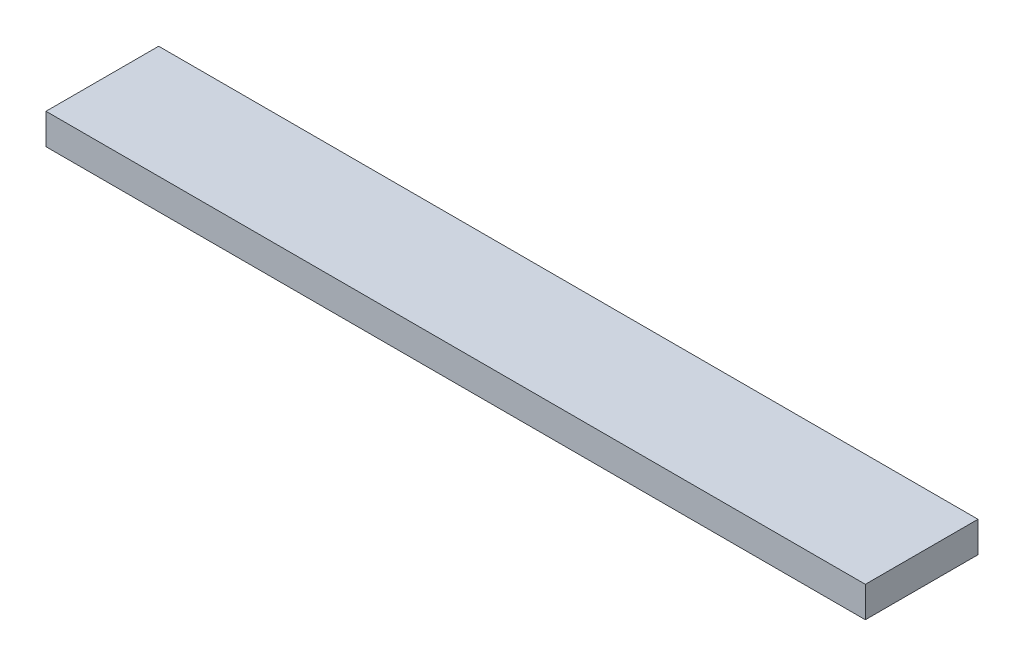
ISO-10303-21;
HEADER;
FILE_DESCRIPTION(('STEP AP214'),'2;1');
FILE_NAME('part.step','',(''),(''),'','','');
FILE_SCHEMA(('AUTOMOTIVE_DESIGN { 1 0 10303 214 1 1 1 1 }'));
ENDSEC;
DATA;
#1=APPLICATION_CONTEXT('core data for automotive mechanical design processes');
#2=APPLICATION_PROTOCOL_DEFINITION('international standard','automotive_design',2000,#1);
#3=PRODUCT_CONTEXT('',#1,'mechanical');
#4=PRODUCT('Part','Part','',(#3));
#5=PRODUCT_RELATED_PRODUCT_CATEGORY('part','',(#4));
#6=PRODUCT_DEFINITION_FORMATION('','',#4);
#7=PRODUCT_DEFINITION_CONTEXT('part definition',#1,'design');
#8=PRODUCT_DEFINITION('design','',#6,#7);
#9=PRODUCT_DEFINITION_SHAPE('','',#8);
#10=(LENGTH_UNIT() NAMED_UNIT(*) SI_UNIT(.MILLI.,.METRE.));
#11=(NAMED_UNIT(*) PLANE_ANGLE_UNIT() SI_UNIT($,.RADIAN.));
#12=(NAMED_UNIT(*) SI_UNIT($,.STERADIAN.) SOLID_ANGLE_UNIT());
#13=UNCERTAINTY_MEASURE_WITH_UNIT(LENGTH_MEASURE(1.E-05),#10,'distance_accuracy_value','');
#14=(GEOMETRIC_REPRESENTATION_CONTEXT(3) GLOBAL_UNCERTAINTY_ASSIGNED_CONTEXT((#13)) GLOBAL_UNIT_ASSIGNED_CONTEXT((#10,
#11,#12)) REPRESENTATION_CONTEXT('',''));
#15=CARTESIAN_POINT('',(0.,0.,0.));
#16=DIRECTION('',(0.,0.,1.));
#17=DIRECTION('',(1.,0.,0.));
#18=AXIS2_PLACEMENT_3D('',#15,#16,#17);
#19=CARTESIAN_POINT('',(0.,19.05,0.));
#20=DIRECTION('',(1.,0.,0.));
#21=DIRECTION('',(0.,0.,-1.));
#22=AXIS2_PLACEMENT_3D('',#19,#20,#21);
#23=PLANE('',#22);
#24=DIRECTION('',(0.,0.,1.));
#25=VECTOR('',#24,1.);
#26=CARTESIAN_POINT('',(0.,0.,0.));
#27=LINE('',#26,#25);
#28=CARTESIAN_POINT('',(0.,0.,-69.85));
#29=VERTEX_POINT('',#28);
#30=CARTESIAN_POINT('',(0.,0.,0.));
#31=VERTEX_POINT('',#30);
#32=EDGE_CURVE('E111',#29,#31,#27,.T.);
#33=ORIENTED_EDGE('',*,*,#32,.T.);
#34=DIRECTION('',(0.,-1.,0.));
#35=VECTOR('',#34,1.);
#36=CARTESIAN_POINT('',(0.,19.05,0.));
#37=LINE('',#36,#35);
#38=CARTESIAN_POINT('',(0.,19.05,0.));
#39=VERTEX_POINT('',#38);
#40=EDGE_CURVE('E11',#39,#31,#37,.T.);
#41=ORIENTED_EDGE('',*,*,#40,.F.);
#42=DIRECTION('',(0.,0.,1.));
#43=VECTOR('',#42,1.);
#44=CARTESIAN_POINT('',(0.,19.05,0.));
#45=LINE('',#44,#43);
#46=CARTESIAN_POINT('',(0.,19.05,-69.85));
#47=VERTEX_POINT('',#46);
#48=EDGE_CURVE('E94',#47,#39,#45,.T.);
#49=ORIENTED_EDGE('',*,*,#48,.F.);
#50=DIRECTION('',(0.,-1.,0.));
#51=VECTOR('',#50,1.);
#52=CARTESIAN_POINT('',(0.,19.05,-69.85));
#53=LINE('',#52,#51);
#54=EDGE_CURVE('E107',#47,#29,#53,.T.);
#55=ORIENTED_EDGE('',*,*,#54,.T.);
#56=EDGE_LOOP('',(#33,#41,#49,#55));
#57=FACE_BOUND('',#56,.T.);
#58=ADVANCED_FACE('F42',(#57),#23,.F.);
#59=CARTESIAN_POINT('',(0.,19.05,0.));
#60=DIRECTION('',(0.,0.,-1.));
#61=DIRECTION('',(-1.,0.,0.));
#62=AXIS2_PLACEMENT_3D('',#59,#60,#61);
#63=PLANE('',#62);
#64=DIRECTION('',(1.,0.,0.));
#65=VECTOR('',#64,1.);
#66=CARTESIAN_POINT('',(0.,0.,0.));
#67=LINE('',#66,#65);
#68=CARTESIAN_POINT('',(508.,0.,0.));
#69=VERTEX_POINT('',#68);
#70=EDGE_CURVE('E99',#31,#69,#67,.T.);
#71=ORIENTED_EDGE('',*,*,#70,.T.);
#72=DIRECTION('',(0.,-1.,0.));
#73=VECTOR('',#72,1.);
#74=CARTESIAN_POINT('',(508.,19.05,0.));
#75=LINE('',#74,#73);
#76=CARTESIAN_POINT('',(508.,19.05,0.));
#77=VERTEX_POINT('',#76);
#78=EDGE_CURVE('E51',#77,#69,#75,.T.);
#79=ORIENTED_EDGE('',*,*,#78,.F.);
#80=DIRECTION('',(1.,0.,0.));
#81=VECTOR('',#80,1.);
#82=CARTESIAN_POINT('',(0.,19.05,0.));
#83=LINE('',#82,#81);
#84=EDGE_CURVE('E89',#39,#77,#83,.T.);
#85=ORIENTED_EDGE('',*,*,#84,.F.);
#86=ORIENTED_EDGE('',*,*,#40,.T.);
#87=EDGE_LOOP('',(#71,#79,#85,#86));
#88=FACE_BOUND('',#87,.T.);
#89=ADVANCED_FACE('F98',(#88),#63,.F.);
#90=CARTESIAN_POINT('',(508.,19.05,0.));
#91=DIRECTION('',(-1.,0.,0.));
#92=DIRECTION('',(0.,0.,1.));
#93=AXIS2_PLACEMENT_3D('',#90,#91,#92);
#94=PLANE('',#93);
#95=DIRECTION('',(0.,0.,-1.));
#96=VECTOR('',#95,1.);
#97=CARTESIAN_POINT('',(508.,0.,0.));
#98=LINE('',#97,#96);
#99=CARTESIAN_POINT('',(508.,0.,-69.85));
#100=VERTEX_POINT('',#99);
#101=EDGE_CURVE('E76',#69,#100,#98,.T.);
#102=ORIENTED_EDGE('',*,*,#101,.T.);
#103=DIRECTION('',(0.,-1.,0.));
#104=VECTOR('',#103,1.);
#105=CARTESIAN_POINT('',(508.,19.05,-69.85));
#106=LINE('',#105,#104);
#107=CARTESIAN_POINT('',(508.,19.05,-69.85));
#108=VERTEX_POINT('',#107);
#109=EDGE_CURVE('E101',#108,#100,#106,.T.);
#110=ORIENTED_EDGE('',*,*,#109,.F.);
#111=DIRECTION('',(0.,0.,-1.));
#112=VECTOR('',#111,1.);
#113=CARTESIAN_POINT('',(508.,19.05,0.));
#114=LINE('',#113,#112);
#115=EDGE_CURVE('E92',#77,#108,#114,.T.);
#116=ORIENTED_EDGE('',*,*,#115,.F.);
#117=ORIENTED_EDGE('',*,*,#78,.T.);
#118=EDGE_LOOP('',(#102,#110,#116,#117));
#119=FACE_BOUND('',#118,.T.);
#120=ADVANCED_FACE('F102',(#119),#94,.F.);
#121=CARTESIAN_POINT('',(0.,19.05,-69.85));
#122=DIRECTION('',(0.,0.,1.));
#123=DIRECTION('',(1.,0.,0.));
#124=AXIS2_PLACEMENT_3D('',#121,#122,#123);
#125=PLANE('',#124);
#126=DIRECTION('',(-1.,0.,0.));
#127=VECTOR('',#126,1.);
#128=CARTESIAN_POINT('',(0.,0.,-69.85));
#129=LINE('',#128,#127);
#130=EDGE_CURVE('E82',#100,#29,#129,.T.);
#131=ORIENTED_EDGE('',*,*,#130,.T.);
#132=ORIENTED_EDGE('',*,*,#54,.F.);
#133=DIRECTION('',(-1.,0.,0.));
#134=VECTOR('',#133,1.);
#135=CARTESIAN_POINT('',(0.,19.05,-69.85));
#136=LINE('',#135,#134);
#137=EDGE_CURVE('E59',#108,#47,#136,.T.);
#138=ORIENTED_EDGE('',*,*,#137,.F.);
#139=ORIENTED_EDGE('',*,*,#109,.T.);
#140=EDGE_LOOP('',(#131,#132,#138,#139));
#141=FACE_BOUND('',#140,.T.);
#142=ADVANCED_FACE('F125',(#141),#125,.F.);
#143=CARTESIAN_POINT('',(0.,19.05,0.));
#144=DIRECTION('',(0.,-1.,0.));
#145=DIRECTION('',(0.,0.,-1.));
#146=AXIS2_PLACEMENT_3D('',#143,#144,#145);
#147=PLANE('',#146);
#148=ORIENTED_EDGE('',*,*,#48,.T.);
#149=ORIENTED_EDGE('',*,*,#84,.T.);
#150=ORIENTED_EDGE('',*,*,#115,.T.);
#151=ORIENTED_EDGE('',*,*,#137,.T.);
#152=EDGE_LOOP('',(#148,#149,#150,#151));
#153=FACE_BOUND('',#152,.T.);
#154=ADVANCED_FACE('F90',(#153),#147,.F.);
#155=CARTESIAN_POINT('',(0.,0.,0.));
#156=DIRECTION('',(0.,-1.,0.));
#157=DIRECTION('',(0.,0.,-1.));
#158=AXIS2_PLACEMENT_3D('',#155,#156,#157);
#159=PLANE('',#158);
#160=ORIENTED_EDGE('',*,*,#32,.F.);
#161=ORIENTED_EDGE('',*,*,#130,.F.);
#162=ORIENTED_EDGE('',*,*,#101,.F.);
#163=ORIENTED_EDGE('',*,*,#70,.F.);
#164=EDGE_LOOP('',(#160,#161,#162,#163));
#165=FACE_BOUND('',#164,.T.);
#166=ADVANCED_FACE('F128',(#165),#159,.T.);
#167=CLOSED_SHELL('',(#58,#89,#120,#142,#154,#166));
#168=MANIFOLD_SOLID_BREP('B2',#167);
#169=ADVANCED_BREP_SHAPE_REPRESENTATION('',(#18,#168),#14);
#170=SHAPE_DEFINITION_REPRESENTATION(#9,#169);
ENDSEC;
END-ISO-10303-21;
